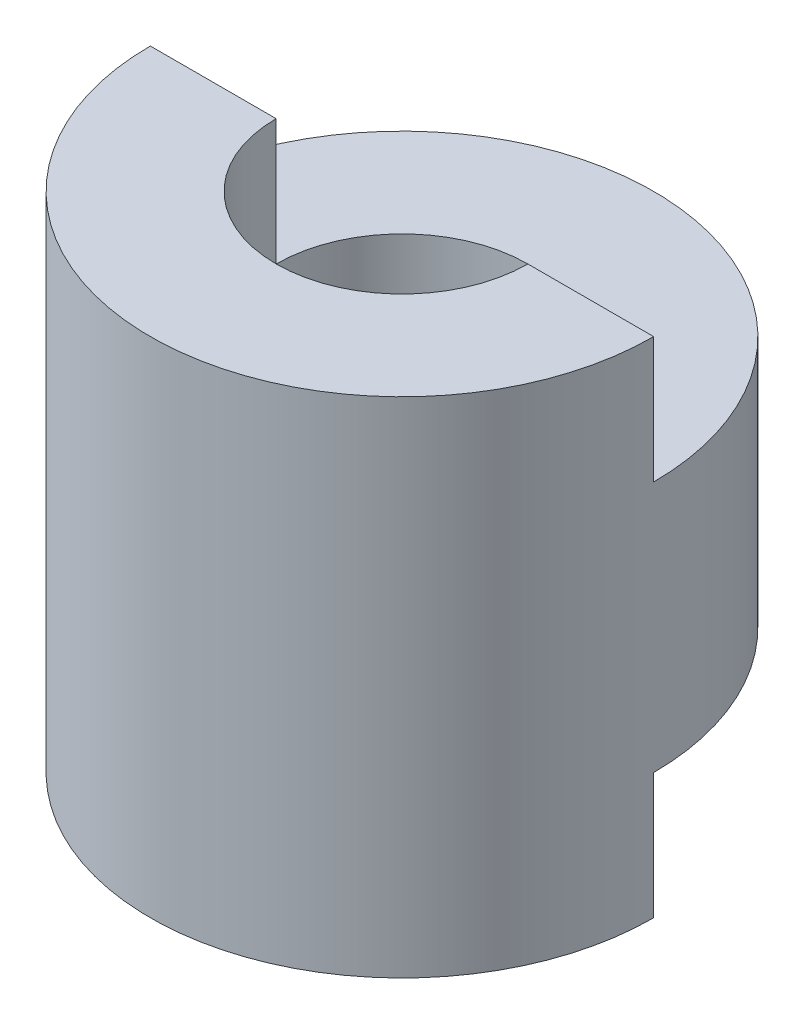
ISO-10303-21;
HEADER;
FILE_DESCRIPTION(('STEP AP214'),'2;1');
FILE_NAME('part.step','',(''),(''),'','','');
FILE_SCHEMA(('AUTOMOTIVE_DESIGN { 1 0 10303 214 1 1 1 1 }'));
ENDSEC;
DATA;
#1=APPLICATION_CONTEXT('core data for automotive mechanical design processes');
#2=APPLICATION_PROTOCOL_DEFINITION('international standard','automotive_design',2000,#1);
#3=PRODUCT_CONTEXT('',#1,'mechanical');
#4=PRODUCT('Part','Part','',(#3));
#5=PRODUCT_RELATED_PRODUCT_CATEGORY('part','',(#4));
#6=PRODUCT_DEFINITION_FORMATION('','',#4);
#7=PRODUCT_DEFINITION_CONTEXT('part definition',#1,'design');
#8=PRODUCT_DEFINITION('design','',#6,#7);
#9=PRODUCT_DEFINITION_SHAPE('','',#8);
#10=(LENGTH_UNIT() NAMED_UNIT(*) SI_UNIT(.MILLI.,.METRE.));
#11=(NAMED_UNIT(*) PLANE_ANGLE_UNIT() SI_UNIT($,.RADIAN.));
#12=(NAMED_UNIT(*) SI_UNIT($,.STERADIAN.) SOLID_ANGLE_UNIT());
#13=UNCERTAINTY_MEASURE_WITH_UNIT(LENGTH_MEASURE(1.E-05),#10,'distance_accuracy_value','');
#14=(GEOMETRIC_REPRESENTATION_CONTEXT(3) GLOBAL_UNCERTAINTY_ASSIGNED_CONTEXT((#13)) GLOBAL_UNIT_ASSIGNED_CONTEXT((#10,
#11,#12)) REPRESENTATION_CONTEXT('',''));
#15=CARTESIAN_POINT('',(0.,0.,0.));
#16=DIRECTION('',(0.,0.,1.));
#17=DIRECTION('',(1.,0.,0.));
#18=AXIS2_PLACEMENT_3D('',#15,#16,#17);
#19=CARTESIAN_POINT('',(0.,20.,0.));
#20=DIRECTION('',(0.,1.,0.));
#21=DIRECTION('',(-1.,0.,0.));
#22=AXIS2_PLACEMENT_3D('',#19,#20,#21);
#23=PLANE('',#22);
#24=DIRECTION('',(1.,0.,0.));
#25=VECTOR('',#24,1.);
#26=CARTESIAN_POINT('',(5.,20.,0.));
#27=LINE('',#26,#25);
#28=CARTESIAN_POINT('',(5.,20.,0.));
#29=VERTEX_POINT('',#28);
#30=CARTESIAN_POINT('',(10.,20.,0.));
#31=VERTEX_POINT('',#30);
#32=EDGE_CURVE('E126',#29,#31,#27,.T.);
#33=ORIENTED_EDGE('',*,*,#32,.F.);
#34=CARTESIAN_POINT('',(0.,20.,0.));
#35=DIRECTION('',(0.,1.,0.));
#36=DIRECTION('',(-1.,0.,0.));
#37=AXIS2_PLACEMENT_3D('',#34,#35,#36);
#38=CIRCLE('',#37,5.);
#39=CARTESIAN_POINT('',(-5.,20.,0.));
#40=VERTEX_POINT('',#39);
#41=EDGE_CURVE('E141',#40,#29,#38,.T.);
#42=ORIENTED_EDGE('',*,*,#41,.F.);
#43=DIRECTION('',(1.,0.,0.));
#44=VECTOR('',#43,1.);
#45=CARTESIAN_POINT('',(-10.,20.,0.));
#46=LINE('',#45,#44);
#47=CARTESIAN_POINT('',(-10.,20.,0.));
#48=VERTEX_POINT('',#47);
#49=EDGE_CURVE('E134',#48,#40,#46,.T.);
#50=ORIENTED_EDGE('',*,*,#49,.F.);
#51=CARTESIAN_POINT('',(0.,20.,0.));
#52=DIRECTION('',(0.,-1.,0.));
#53=DIRECTION('',(1.,0.,0.));
#54=AXIS2_PLACEMENT_3D('',#51,#52,#53);
#55=CIRCLE('',#54,10.);
#56=EDGE_CURVE('E11',#31,#48,#55,.T.);
#57=ORIENTED_EDGE('',*,*,#56,.F.);
#58=EDGE_LOOP('',(#33,#42,#50,#57));
#59=FACE_BOUND('',#58,.T.);
#60=ADVANCED_FACE('F33',(#59),#23,.T.);
#61=CARTESIAN_POINT('',(0.,0.,0.));
#62=DIRECTION('',(0.,-1.,0.));
#63=DIRECTION('',(1.,0.,0.));
#64=AXIS2_PLACEMENT_3D('',#61,#62,#63);
#65=CYLINDRICAL_SURFACE('',#64,10.);
#66=DIRECTION('',(0.,-1.,0.));
#67=VECTOR('',#66,1.);
#68=CARTESIAN_POINT('',(-10.,5.,0.));
#69=LINE('',#68,#67);
#70=CARTESIAN_POINT('',(-10.,5.,0.));
#71=VERTEX_POINT('',#70);
#72=CARTESIAN_POINT('',(-10.,0.,0.));
#73=VERTEX_POINT('',#72);
#74=EDGE_CURVE('E136',#71,#73,#69,.T.);
#75=ORIENTED_EDGE('',*,*,#74,.T.);
#76=CARTESIAN_POINT('',(0.,0.,0.));
#77=DIRECTION('',(0.,-1.,0.));
#78=DIRECTION('',(1.,0.,0.));
#79=AXIS2_PLACEMENT_3D('',#76,#77,#78);
#80=CIRCLE('',#79,10.);
#81=CARTESIAN_POINT('',(10.,0.,0.));
#82=VERTEX_POINT('',#81);
#83=EDGE_CURVE('E40',#82,#73,#80,.T.);
#84=ORIENTED_EDGE('',*,*,#83,.F.);
#85=DIRECTION('',(0.,-1.,0.));
#86=VECTOR('',#85,1.);
#87=CARTESIAN_POINT('',(10.,5.,0.));
#88=LINE('',#87,#86);
#89=CARTESIAN_POINT('',(10.,5.,0.));
#90=VERTEX_POINT('',#89);
#91=EDGE_CURVE('E97',#90,#82,#88,.T.);
#92=ORIENTED_EDGE('',*,*,#91,.F.);
#93=CARTESIAN_POINT('',(0.,5.,0.));
#94=DIRECTION('',(0.,-1.,0.));
#95=DIRECTION('',(1.,0.,0.));
#96=AXIS2_PLACEMENT_3D('',#93,#94,#95);
#97=CIRCLE('',#96,10.);
#98=EDGE_CURVE('E103',#71,#90,#97,.T.);
#99=ORIENTED_EDGE('',*,*,#98,.F.);
#100=EDGE_LOOP('',(#75,#84,#92,#99));
#101=FACE_BOUND('',#100,.T.);
#102=DIRECTION('',(0.,1.,0.));
#103=VECTOR('',#102,1.);
#104=CARTESIAN_POINT('',(10.,15.,0.));
#105=LINE('',#104,#103);
#106=CARTESIAN_POINT('',(10.,15.,0.));
#107=VERTEX_POINT('',#106);
#108=EDGE_CURVE('E138',#107,#31,#105,.T.);
#109=ORIENTED_EDGE('',*,*,#108,.T.);
#110=ORIENTED_EDGE('',*,*,#56,.T.);
#111=DIRECTION('',(0.,1.,0.));
#112=VECTOR('',#111,1.);
#113=CARTESIAN_POINT('',(-10.,15.,0.));
#114=LINE('',#113,#112);
#115=CARTESIAN_POINT('',(-10.,15.,0.));
#116=VERTEX_POINT('',#115);
#117=EDGE_CURVE('E133',#116,#48,#114,.T.);
#118=ORIENTED_EDGE('',*,*,#117,.F.);
#119=CARTESIAN_POINT('',(0.,15.,0.));
#120=DIRECTION('',(0.,1.,0.));
#121=DIRECTION('',(1.,0.,0.));
#122=AXIS2_PLACEMENT_3D('',#119,#120,#121);
#123=CIRCLE('',#122,10.);
#124=EDGE_CURVE('E124',#107,#116,#123,.T.);
#125=ORIENTED_EDGE('',*,*,#124,.F.);
#126=EDGE_LOOP('',(#109,#110,#118,#125));
#127=FACE_BOUND('',#126,.T.);
#128=ADVANCED_FACE('F115',(#101,#127),#65,.T.);
#129=CARTESIAN_POINT('',(0.,0.,0.));
#130=DIRECTION('',(0.,-1.,0.));
#131=DIRECTION('',(1.,0.,0.));
#132=AXIS2_PLACEMENT_3D('',#129,#130,#131);
#133=PLANE('',#132);
#134=DIRECTION('',(-1.,0.,0.));
#135=VECTOR('',#134,1.);
#136=CARTESIAN_POINT('',(-10.,0.,0.));
#137=LINE('',#136,#135);
#138=CARTESIAN_POINT('',(-5.,0.,0.));
#139=VERTEX_POINT('',#138);
#140=EDGE_CURVE('E112',#139,#73,#137,.T.);
#141=ORIENTED_EDGE('',*,*,#140,.F.);
#142=CARTESIAN_POINT('',(0.,0.,0.));
#143=DIRECTION('',(0.,1.,0.));
#144=DIRECTION('',(-1.,0.,0.));
#145=AXIS2_PLACEMENT_3D('',#142,#143,#144);
#146=CIRCLE('',#145,5.);
#147=CARTESIAN_POINT('',(5.,0.,0.));
#148=VERTEX_POINT('',#147);
#149=EDGE_CURVE('E148',#139,#148,#146,.T.);
#150=ORIENTED_EDGE('',*,*,#149,.T.);
#151=DIRECTION('',(-1.,0.,0.));
#152=VECTOR('',#151,1.);
#153=CARTESIAN_POINT('',(5.,0.,0.));
#154=LINE('',#153,#152);
#155=EDGE_CURVE('E156',#82,#148,#154,.T.);
#156=ORIENTED_EDGE('',*,*,#155,.F.);
#157=ORIENTED_EDGE('',*,*,#83,.T.);
#158=EDGE_LOOP('',(#141,#150,#156,#157));
#159=FACE_BOUND('',#158,.T.);
#160=ADVANCED_FACE('F154',(#159),#133,.T.);
#161=CARTESIAN_POINT('',(0.,0.,0.));
#162=DIRECTION('',(0.,1.,0.));
#163=DIRECTION('',(-1.,0.,0.));
#164=AXIS2_PLACEMENT_3D('',#161,#162,#163);
#165=CYLINDRICAL_SURFACE('',#164,5.);
#166=ORIENTED_EDGE('',*,*,#149,.F.);
#167=DIRECTION('',(0.,-1.,0.));
#168=VECTOR('',#167,1.);
#169=CARTESIAN_POINT('',(-5.,5.,0.));
#170=LINE('',#169,#168);
#171=CARTESIAN_POINT('',(-5.,5.,0.));
#172=VERTEX_POINT('',#171);
#173=EDGE_CURVE('E119',#172,#139,#170,.T.);
#174=ORIENTED_EDGE('',*,*,#173,.F.);
#175=CARTESIAN_POINT('',(0.,5.,0.));
#176=DIRECTION('',(0.,1.,0.));
#177=DIRECTION('',(1.,0.,0.));
#178=AXIS2_PLACEMENT_3D('',#175,#176,#177);
#179=CIRCLE('',#178,5.);
#180=CARTESIAN_POINT('',(5.,5.,0.));
#181=VERTEX_POINT('',#180);
#182=EDGE_CURVE('E102',#181,#172,#179,.T.);
#183=ORIENTED_EDGE('',*,*,#182,.F.);
#184=DIRECTION('',(0.,-1.,0.));
#185=VECTOR('',#184,1.);
#186=CARTESIAN_POINT('',(5.,5.,0.));
#187=LINE('',#186,#185);
#188=EDGE_CURVE('E100',#181,#148,#187,.T.);
#189=ORIENTED_EDGE('',*,*,#188,.T.);
#190=EDGE_LOOP('',(#166,#174,#183,#189));
#191=FACE_BOUND('',#190,.T.);
#192=ORIENTED_EDGE('',*,*,#41,.T.);
#193=DIRECTION('',(0.,1.,0.));
#194=VECTOR('',#193,1.);
#195=CARTESIAN_POINT('',(5.,15.,0.));
#196=LINE('',#195,#194);
#197=CARTESIAN_POINT('',(5.,15.,0.));
#198=VERTEX_POINT('',#197);
#199=EDGE_CURVE('E142',#198,#29,#196,.T.);
#200=ORIENTED_EDGE('',*,*,#199,.F.);
#201=CARTESIAN_POINT('',(0.,15.,0.));
#202=DIRECTION('',(0.,-1.,0.));
#203=DIRECTION('',(1.,0.,0.));
#204=AXIS2_PLACEMENT_3D('',#201,#202,#203);
#205=CIRCLE('',#204,5.);
#206=CARTESIAN_POINT('',(-5.,15.,0.));
#207=VERTEX_POINT('',#206);
#208=EDGE_CURVE('E128',#207,#198,#205,.T.);
#209=ORIENTED_EDGE('',*,*,#208,.F.);
#210=DIRECTION('',(0.,1.,0.));
#211=VECTOR('',#210,1.);
#212=CARTESIAN_POINT('',(-5.,15.,0.));
#213=LINE('',#212,#211);
#214=EDGE_CURVE('E144',#207,#40,#213,.T.);
#215=ORIENTED_EDGE('',*,*,#214,.T.);
#216=EDGE_LOOP('',(#192,#200,#209,#215));
#217=FACE_BOUND('',#216,.T.);
#218=ADVANCED_FACE('F165',(#191,#217),#165,.F.);
#219=CARTESIAN_POINT('',(5.,15.,0.));
#220=DIRECTION('',(0.,0.,1.));
#221=DIRECTION('',(1.,0.,0.));
#222=AXIS2_PLACEMENT_3D('',#219,#220,#221);
#223=PLANE('',#222);
#224=ORIENTED_EDGE('',*,*,#32,.T.);
#225=ORIENTED_EDGE('',*,*,#108,.F.);
#226=DIRECTION('',(1.,0.,0.));
#227=VECTOR('',#226,1.);
#228=CARTESIAN_POINT('',(5.,15.,0.));
#229=LINE('',#228,#227);
#230=EDGE_CURVE('E130',#198,#107,#229,.T.);
#231=ORIENTED_EDGE('',*,*,#230,.F.);
#232=ORIENTED_EDGE('',*,*,#199,.T.);
#233=EDGE_LOOP('',(#224,#225,#231,#232));
#234=FACE_BOUND('',#233,.T.);
#235=ADVANCED_FACE('F168',(#234),#223,.F.);
#236=CARTESIAN_POINT('',(-10.,15.,0.));
#237=DIRECTION('',(0.,0.,1.));
#238=DIRECTION('',(1.,0.,0.));
#239=AXIS2_PLACEMENT_3D('',#236,#237,#238);
#240=PLANE('',#239);
#241=ORIENTED_EDGE('',*,*,#49,.T.);
#242=ORIENTED_EDGE('',*,*,#214,.F.);
#243=DIRECTION('',(1.,0.,0.));
#244=VECTOR('',#243,1.);
#245=CARTESIAN_POINT('',(-10.,15.,0.));
#246=LINE('',#245,#244);
#247=EDGE_CURVE('E55',#116,#207,#246,.T.);
#248=ORIENTED_EDGE('',*,*,#247,.F.);
#249=ORIENTED_EDGE('',*,*,#117,.T.);
#250=EDGE_LOOP('',(#241,#242,#248,#249));
#251=FACE_BOUND('',#250,.T.);
#252=ADVANCED_FACE('F183',(#251),#240,.F.);
#253=CARTESIAN_POINT('',(0.,15.,0.));
#254=DIRECTION('',(0.,-1.,0.));
#255=DIRECTION('',(1.,0.,0.));
#256=AXIS2_PLACEMENT_3D('',#253,#254,#255);
#257=PLANE('',#256);
#258=ORIENTED_EDGE('',*,*,#124,.T.);
#259=ORIENTED_EDGE('',*,*,#247,.T.);
#260=ORIENTED_EDGE('',*,*,#208,.T.);
#261=ORIENTED_EDGE('',*,*,#230,.T.);
#262=EDGE_LOOP('',(#258,#259,#260,#261));
#263=FACE_BOUND('',#262,.T.);
#264=ADVANCED_FACE('F181',(#263),#257,.F.);
#265=CARTESIAN_POINT('',(-10.,5.,0.));
#266=DIRECTION('',(0.,0.,1.));
#267=DIRECTION('',(1.,0.,0.));
#268=AXIS2_PLACEMENT_3D('',#265,#266,#267);
#269=PLANE('',#268);
#270=ORIENTED_EDGE('',*,*,#140,.T.);
#271=ORIENTED_EDGE('',*,*,#74,.F.);
#272=DIRECTION('',(-1.,0.,0.));
#273=VECTOR('',#272,1.);
#274=CARTESIAN_POINT('',(-10.,5.,0.));
#275=LINE('',#274,#273);
#276=EDGE_CURVE('E109',#172,#71,#275,.T.);
#277=ORIENTED_EDGE('',*,*,#276,.F.);
#278=ORIENTED_EDGE('',*,*,#173,.T.);
#279=EDGE_LOOP('',(#270,#271,#277,#278));
#280=FACE_BOUND('',#279,.T.);
#281=ADVANCED_FACE('F163',(#280),#269,.F.);
#282=CARTESIAN_POINT('',(5.,5.,0.));
#283=DIRECTION('',(0.,0.,1.));
#284=DIRECTION('',(1.,0.,0.));
#285=AXIS2_PLACEMENT_3D('',#282,#283,#284);
#286=PLANE('',#285);
#287=ORIENTED_EDGE('',*,*,#155,.T.);
#288=ORIENTED_EDGE('',*,*,#188,.F.);
#289=DIRECTION('',(-1.,0.,0.));
#290=VECTOR('',#289,1.);
#291=CARTESIAN_POINT('',(5.,5.,0.));
#292=LINE('',#291,#290);
#293=EDGE_CURVE('E47',#90,#181,#292,.T.);
#294=ORIENTED_EDGE('',*,*,#293,.F.);
#295=ORIENTED_EDGE('',*,*,#91,.T.);
#296=EDGE_LOOP('',(#287,#288,#294,#295));
#297=FACE_BOUND('',#296,.T.);
#298=ADVANCED_FACE('F95',(#297),#286,.F.);
#299=CARTESIAN_POINT('',(0.,5.,0.));
#300=DIRECTION('',(0.,-1.,0.));
#301=DIRECTION('',(1.,0.,0.));
#302=AXIS2_PLACEMENT_3D('',#299,#300,#301);
#303=PLANE('',#302);
#304=ORIENTED_EDGE('',*,*,#98,.T.);
#305=ORIENTED_EDGE('',*,*,#293,.T.);
#306=ORIENTED_EDGE('',*,*,#182,.T.);
#307=ORIENTED_EDGE('',*,*,#276,.T.);
#308=EDGE_LOOP('',(#304,#305,#306,#307));
#309=FACE_BOUND('',#308,.T.);
#310=ADVANCED_FACE('F107',(#309),#303,.T.);
#311=CLOSED_SHELL('',(#60,#128,#160,#218,#235,#252,#264,#281,#298,#310));
#312=MANIFOLD_SOLID_BREP('B2',#311);
#313=ADVANCED_BREP_SHAPE_REPRESENTATION('',(#18,#312),#14);
#314=SHAPE_DEFINITION_REPRESENTATION(#9,#313);
ENDSEC;
END-ISO-10303-21;
